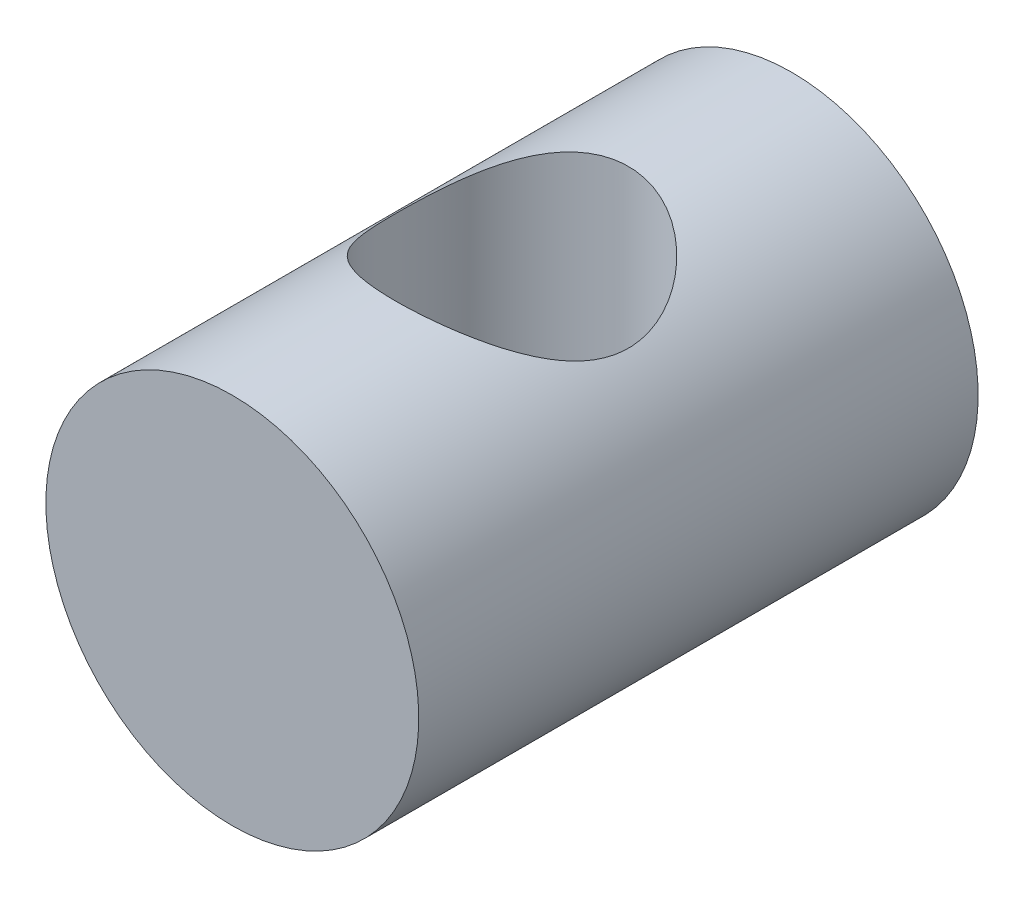
ISO-10303-21;
HEADER;
FILE_DESCRIPTION(('STEP AP214'),'2;1');
FILE_NAME('part.step','',(''),(''),'','','');
FILE_SCHEMA(('AUTOMOTIVE_DESIGN { 1 0 10303 214 1 1 1 1 }'));
ENDSEC;
DATA;
#1=APPLICATION_CONTEXT('core data for automotive mechanical design processes');
#2=APPLICATION_PROTOCOL_DEFINITION('international standard','automotive_design',2000,#1);
#3=PRODUCT_CONTEXT('',#1,'mechanical');
#4=PRODUCT('Part','Part','',(#3));
#5=PRODUCT_RELATED_PRODUCT_CATEGORY('part','',(#4));
#6=PRODUCT_DEFINITION_FORMATION('','',#4);
#7=PRODUCT_DEFINITION_CONTEXT('part definition',#1,'design');
#8=PRODUCT_DEFINITION('design','',#6,#7);
#9=PRODUCT_DEFINITION_SHAPE('','',#8);
#10=(LENGTH_UNIT() NAMED_UNIT(*) SI_UNIT(.MILLI.,.METRE.));
#11=(NAMED_UNIT(*) PLANE_ANGLE_UNIT() SI_UNIT($,.RADIAN.));
#12=(NAMED_UNIT(*) SI_UNIT($,.STERADIAN.) SOLID_ANGLE_UNIT());
#13=UNCERTAINTY_MEASURE_WITH_UNIT(LENGTH_MEASURE(1.E-05),#10,'distance_accuracy_value','');
#14=(GEOMETRIC_REPRESENTATION_CONTEXT(3) GLOBAL_UNCERTAINTY_ASSIGNED_CONTEXT((#13)) GLOBAL_UNIT_ASSIGNED_CONTEXT((#10,
#11,#12)) REPRESENTATION_CONTEXT('',''));
#15=CARTESIAN_POINT('',(0.,0.,0.));
#16=DIRECTION('',(0.,0.,1.));
#17=DIRECTION('',(1.,0.,0.));
#18=AXIS2_PLACEMENT_3D('',#15,#16,#17);
#19=CARTESIAN_POINT('',(0.,4.00000000000001,6.));
#20=DIRECTION('',(0.,0.,-1.));
#21=DIRECTION('',(0.,1.,0.));
#22=AXIS2_PLACEMENT_3D('',#19,#20,#21);
#23=PLANE('',#22);
#24=CARTESIAN_POINT('',(0.,0.,6.));
#25=DIRECTION('',(0.,0.,1.));
#26=DIRECTION('',(0.,-1.,0.));
#27=AXIS2_PLACEMENT_3D('',#24,#25,#26);
#28=CIRCLE('',#27,4.00000000000001);
#29=CARTESIAN_POINT('',(0.,-4.00000000000001,6.));
#30=VERTEX_POINT('',#29);
#31=EDGE_CURVE('E48',#30,#30,#28,.T.);
#32=ORIENTED_EDGE('',*,*,#31,.T.);
#33=EDGE_LOOP('',(#32));
#34=FACE_BOUND('',#33,.T.);
#35=ADVANCED_FACE('F30',(#34),#23,.F.);
#36=CARTESIAN_POINT('',(0.,4.,-6.));
#37=DIRECTION('',(0.,0.,1.));
#38=DIRECTION('',(0.,-1.,0.));
#39=AXIS2_PLACEMENT_3D('',#36,#37,#38);
#40=PLANE('',#39);
#41=CARTESIAN_POINT('',(0.,0.,-6.));
#42=DIRECTION('',(0.,0.,1.));
#43=DIRECTION('',(0.,-1.,0.));
#44=AXIS2_PLACEMENT_3D('',#41,#42,#43);
#45=CIRCLE('',#44,4.);
#46=CARTESIAN_POINT('',(0.,-4.,-6.));
#47=VERTEX_POINT('',#46);
#48=EDGE_CURVE('E44',#47,#47,#45,.T.);
#49=ORIENTED_EDGE('',*,*,#48,.F.);
#50=EDGE_LOOP('',(#49));
#51=FACE_BOUND('',#50,.T.);
#52=ADVANCED_FACE('F63',(#51),#40,.F.);
#53=CARTESIAN_POINT('',(0.,0.,6.));
#54=DIRECTION('',(0.,0.,1.));
#55=DIRECTION('',(0.,-1.,0.));
#56=AXIS2_PLACEMENT_3D('',#53,#54,#55);
#57=CYLINDRICAL_SURFACE('',#56,4.);
#58=CARTESIAN_POINT('',(0.,-4.,2.5));
#59=CARTESIAN_POINT('',(0.127017476559871,-3.99999041333572,2.49998952385639));
#60=CARTESIAN_POINT('',(0.254191951791703,-3.9938860659399,2.49025350009832));
#61=CARTESIAN_POINT('',(0.504637456621344,-3.97004375552587,2.45182887031573));
#62=CARTESIAN_POINT('',(0.627900575825985,-3.95228361873138,2.42310413973879));
#63=CARTESIAN_POINT('',(0.866410868269162,-3.90691695293563,2.34837714671246));
#64=CARTESIAN_POINT('',(0.98169442070943,-3.87935918690877,2.30246039021243));
#65=CARTESIAN_POINT('',(1.20252080434994,-3.81669199838278,2.19522833250853));
#66=CARTESIAN_POINT('',(1.30806471304098,-3.7815834126609,2.13391473744688));
#67=CARTESIAN_POINT('',(1.51594836437078,-3.70340304945467,1.9922268434089));
#68=CARTESIAN_POINT('',(1.61735911616791,-3.65991924217889,1.91072139729824));
#69=CARTESIAN_POINT('',(1.80597275567284,-3.57062700058922,1.73356165374148));
#70=CARTESIAN_POINT('',(1.89315621594405,-3.52481549782958,1.63788834426107));
#71=CARTESIAN_POINT('',(2.06285746302521,-3.42860837235627,1.41993221070879));
#72=CARTESIAN_POINT('',(2.14314412018317,-3.37843221966147,1.29580042656906));
#73=CARTESIAN_POINT('',(2.28147932079995,-3.28660396278105,1.03287036932165));
#74=CARTESIAN_POINT('',(2.33956541787438,-3.24493752000461,0.894097374832021));
#75=CARTESIAN_POINT('',(2.41866801180576,-3.18619151248815,0.642378952454283));
#76=CARTESIAN_POINT('',(2.44539104794679,-3.16553811970886,0.532066363081685));
#77=CARTESIAN_POINT('',(2.4836368711914,-3.1356271466086,0.307388148619314));
#78=CARTESIAN_POINT('',(2.49518112485638,-3.12635347378457,0.193028482826788));
#79=CARTESIAN_POINT('',(2.50237836690497,-3.12059771534501,-0.0368260328763664));
#80=CARTESIAN_POINT('',(2.49798968200884,-3.12414917427958,-0.15232307057796));
#81=CARTESIAN_POINT('',(2.47352633347829,-3.14354804883412,-0.380620208726635));
#82=CARTESIAN_POINT('',(2.45343909745149,-3.1594053196549,-0.493418072849926));
#83=CARTESIAN_POINT('',(2.3993620946426,-3.20065145822146,-0.710876896743595));
#84=CARTESIAN_POINT('',(2.36570043522604,-3.22581428653572,-0.815664879717374));
#85=CARTESIAN_POINT('',(2.28580369589507,-3.28291134443419,-1.01832239647321));
#86=CARTESIAN_POINT('',(2.2395641689404,-3.31484796808523,-1.11618946784346));
#87=CARTESIAN_POINT('',(2.12589830407261,-3.38909625095659,-1.32166640751016));
#88=CARTESIAN_POINT('',(2.05612773657747,-3.43223155208551,-1.42768105185238));
#89=CARTESIAN_POINT('',(1.90176111958637,-3.52011451554715,-1.6276611269764));
#90=CARTESIAN_POINT('',(1.81714983251341,-3.56486379714023,-1.72161400004514));
#91=CARTESIAN_POINT('',(1.61904732877734,-3.65959667460597,-1.91060100958261));
#92=CARTESIAN_POINT('',(1.50309447420016,-3.70922571443729,-2.0032559427216));
#93=CARTESIAN_POINT('',(1.25426444468514,-3.8005660184067,-2.16771179363102));
#94=CARTESIAN_POINT('',(1.12139395127005,-3.84228039228673,-2.23952090780949));
#95=CARTESIAN_POINT('',(0.91577575156744,-3.89435975869903,-2.32734595663498));
#96=CARTESIAN_POINT('',(0.848193583187391,-3.90966874385269,-2.3528342864304));
#97=CARTESIAN_POINT('',(0.710492049478443,-3.93701839875445,-2.39800765047864));
#98=CARTESIAN_POINT('',(0.640374175967897,-3.94906095588034,-2.41769603657082));
#99=CARTESIAN_POINT('',(0.49823901953847,-3.9694969952785,-2.45093416164239));
#100=CARTESIAN_POINT('',(0.426223500915274,-3.97789374843885,-2.464489403526));
#101=CARTESIAN_POINT('',(0.280965673560731,-3.99078766491331,-2.48524629331357));
#102=CARTESIAN_POINT('',(0.20772357657075,-3.99528549435854,-2.49244902654731));
#103=CARTESIAN_POINT('',(0.00911917689680461,-4.00193773474168,-2.50310930464354));
#104=CARTESIAN_POINT('',(-0.116782016705696,-4.00023812236601,-2.50040036312352));
#105=CARTESIAN_POINT('',(-0.365967766011668,-3.98518313408306,-2.47624033553455));
#106=CARTESIAN_POINT('',(-0.48925249935995,-3.97182855210102,-2.45479052607527));
#107=CARTESIAN_POINT('',(-0.725036194002601,-3.9354797555537,-2.39552141201722));
#108=CARTESIAN_POINT('',(-0.837768421062912,-3.91288306371127,-2.35837527923021));
#109=CARTESIAN_POINT('',(-1.05527816125332,-3.85991402897875,-2.26940762868757));
#110=CARTESIAN_POINT('',(-1.16005433861599,-3.82954038411642,-2.21758365349857));
#111=CARTESIAN_POINT('',(-1.37016761969194,-3.75980014020658,-2.09496946249217));
#112=CARTESIAN_POINT('',(-1.47449380296905,-3.71983526755373,-2.02279282772497));
#113=CARTESIAN_POINT('',(-1.67028541330073,-3.63613942885727,-1.86441230353071));
#114=CARTESIAN_POINT('',(-1.76173634038025,-3.59240430473134,-1.77819283111431));
#115=CARTESIAN_POINT('',(-1.94294835276253,-3.49811738486729,-1.57972991015435));
#116=CARTESIAN_POINT('',(-2.03053702733638,-3.44749766579192,-1.46552558450247));
#117=CARTESIAN_POINT('',(-2.18560704916439,-3.35133525746893,-1.22224843301743));
#118=CARTESIAN_POINT('',(-2.25310231693768,-3.3057890670837,-1.09318598710868));
#119=CARTESIAN_POINT('',(-2.35369543821018,-3.2346706057884,-0.850615703400426));
#120=CARTESIAN_POINT('',(-2.39103791720685,-3.20691272363805,-0.739518498611291));
#121=CARTESIAN_POINT('',(-2.45000216420748,-3.16210061351252,-0.511213708386551));
#122=CARTESIAN_POINT('',(-2.47164849805251,-3.14502966529821,-0.394015980310569));
#123=CARTESIAN_POINT('',(-2.49802767469226,-3.12412649932601,-0.155819447029602));
#124=CARTESIAN_POINT('',(-2.50266374586469,-3.12037003193166,-0.0348028321200665));
#125=CARTESIAN_POINT('',(-2.49439556773531,-3.12698126375719,0.206261923829517));
#126=CARTESIAN_POINT('',(-2.48148548821457,-3.1373536577048,0.326309729619358));
#127=CARTESIAN_POINT('',(-2.44076547086104,-3.1691077700999,0.55205957943611));
#128=CARTESIAN_POINT('',(-2.41423847191721,-3.18953614189074,0.65813856450238));
#129=CARTESIAN_POINT('',(-2.34835238743426,-3.23835062785226,0.86427015751826));
#130=CARTESIAN_POINT('',(-2.3089879509078,-3.26674005971309,0.964320231817276));
#131=CARTESIAN_POINT('',(-2.21205415803959,-3.33327797617853,1.17119332433814));
#132=CARTESIAN_POINT('',(-2.15267427981667,-3.3722442852408,1.27689994626374));
#133=CARTESIAN_POINT('',(-2.01999894889208,-3.45335445323995,1.47787738570926));
#134=CARTESIAN_POINT('',(-1.94669224594686,-3.49550086439,1.57313966737408));
#135=CARTESIAN_POINT('',(-1.77134669685941,-3.58803675426846,1.77002558379843));
#136=CARTESIAN_POINT('',(-1.66649284489892,-3.63840488260278,1.86916976153929));
#137=CARTESIAN_POINT('',(-1.43961937990848,-3.73398053838231,2.04900159612506));
#138=CARTESIAN_POINT('',(-1.3175892119665,-3.77918486147259,2.12967782367752));
#139=CARTESIAN_POINT('',(-1.12346357942551,-3.83959214728416,2.23456343855876));
#140=CARTESIAN_POINT('',(-1.05679601158094,-3.85851834157058,2.26687480004699));
#141=CARTESIAN_POINT('',(-0.920199584374059,-3.89335165397882,2.32567225182379));
#142=CARTESIAN_POINT('',(-0.850272633931981,-3.90926051225921,2.3521617011351));
#143=CARTESIAN_POINT('',(-0.707873688437763,-3.93753374175518,2.39885714446217));
#144=CARTESIAN_POINT('',(-0.635409144572261,-3.94990764965183,2.41908005724566));
#145=CARTESIAN_POINT('',(-0.488456989557111,-3.97075677458059,2.45297545558237));
#146=CARTESIAN_POINT('',(-0.413970913545524,-3.97923486692924,2.46665277243948));
#147=CARTESIAN_POINT('',(-0.282852605094048,-3.99038271291772,2.48459041022673));
#148=CARTESIAN_POINT('',(-0.226501515914867,-3.99398159517596,2.49036153025218));
#149=CARTESIAN_POINT('',(-0.113444074519046,-3.99879245372932,2.49806878362715));
#150=CARTESIAN_POINT('',(-0.0567377005313051,-4.00000428228699,2.50000467961036));
#151=CARTESIAN_POINT('',(0.,-4.,2.5));
#152=B_SPLINE_CURVE_WITH_KNOTS('',3,(#58,#59,#60,#61,#62,#63,#64,#65,#66,#67,#68,#69,#70,#71,
#72,#73,#74,#75,#76,#77,#78,#79,#80,#81,#82,#83,#84,#85,#86,#87,#88,#89,#90,#91,#92,#93,#94,#95,
#96,#97,#98,#99,#100,#101,#102,#103,#104,#105,#106,#107,#108,#109,#110,#111,#112,#113,#114,#115,
#116,#117,#118,#119,#120,#121,#122,#123,#124,#125,#126,#127,#128,#129,#130,#131,#132,#133,#134,
#135,#136,#137,#138,#139,#140,#141,#142,#143,#144,#145,#146,#147,#148,#149,#150,#151),
.UNSPECIFIED.,.T.,.F.,(4,2,2,2,2,2,2,2,2,2,2,2,2,2,2,2,2,2,2,2,2,2,2,2,2,2,2,2,2,2,2,2,2,2,2,2,
2,2,2,2,2,2,2,2,2,2,4),(0.,0.380824602868265,0.762375788256924,1.14205397519027,
1.52169010807759,1.93164374107244,2.34215256651403,2.80825951705947,3.27357449214021,
3.61824017759434,3.96241789414782,4.30749646997556,4.65285169010166,4.99031678920873,
5.32790135816066,5.7285490070872,6.12961045150364,6.59684361399044,7.06389281455723,
7.28510978359956,7.50619865744383,7.72708876613707,7.94794112831293,8.32363778110177,
8.69930884379593,9.06028425977629,9.42132014771965,9.81879878896137,10.216721545704,
10.6724083464246,11.1277787130885,11.4876929754247,11.8470427174174,12.2084336629143,
12.5699447204276,12.9023575499051,13.2349091154192,13.6156046298899,13.9966089922257,
14.4531049498526,14.9098826607203,15.1389848639481,15.3679545348469,15.5963005225023,
15.8244777070605,15.994578512822,16.1646898459841),.UNSPECIFIED.);
#153=CARTESIAN_POINT('',(0.,-4.,2.5));
#154=VERTEX_POINT('',#153);
#155=EDGE_CURVE('E10',#154,#154,#152,.T.);
#156=ORIENTED_EDGE('',*,*,#155,.T.);
#157=EDGE_LOOP('',(#156));
#158=FACE_BOUND('',#157,.T.);
#159=CARTESIAN_POINT('',(0.,4.00000000000001,2.5));
#160=CARTESIAN_POINT('',(-0.127017476559871,3.99999041333572,2.49998952385639));
#161=CARTESIAN_POINT('',(-0.254191951791703,3.9938860659399,2.49025350009832));
#162=CARTESIAN_POINT('',(-0.504637456621344,3.97004375552587,2.45182887031573));
#163=CARTESIAN_POINT('',(-0.627900575825985,3.95228361873138,2.4231041397388));
#164=CARTESIAN_POINT('',(-0.866410868269161,3.90691695293563,2.34837714671246));
#165=CARTESIAN_POINT('',(-0.981694420709429,3.87935918690877,2.30246039021243));
#166=CARTESIAN_POINT('',(-1.20252080434994,3.81669199838278,2.19522833250853));
#167=CARTESIAN_POINT('',(-1.30806471304098,3.7815834126609,2.13391473744688));
#168=CARTESIAN_POINT('',(-1.51594836437078,3.70340304945467,1.9922268434089));
#169=CARTESIAN_POINT('',(-1.61735911616791,3.65991924217889,1.91072139729824));
#170=CARTESIAN_POINT('',(-1.80597275567284,3.57062700058922,1.73356165374148));
#171=CARTESIAN_POINT('',(-1.89315621594404,3.52481549782958,1.63788834426107));
#172=CARTESIAN_POINT('',(-2.06285746302521,3.42860837235627,1.4199322107088));
#173=CARTESIAN_POINT('',(-2.14314412018317,3.37843221966147,1.29580042656906));
#174=CARTESIAN_POINT('',(-2.28147932079995,3.28660396278105,1.03287036932165));
#175=CARTESIAN_POINT('',(-2.33956541787438,3.24493752000461,0.894097374832024));
#176=CARTESIAN_POINT('',(-2.41866801180576,3.18619151248815,0.642378952454286));
#177=CARTESIAN_POINT('',(-2.44539104794679,3.16553811970886,0.532066363081687));
#178=CARTESIAN_POINT('',(-2.4836368711914,3.1356271466086,0.307388148619316));
#179=CARTESIAN_POINT('',(-2.49518112485638,3.12635347378457,0.19302848282679));
#180=CARTESIAN_POINT('',(-2.50237836690497,3.12059771534501,-0.0368260328763648));
#181=CARTESIAN_POINT('',(-2.49798968200884,3.12414917427958,-0.152323070577958));
#182=CARTESIAN_POINT('',(-2.47352633347829,3.14354804883412,-0.380620208726633));
#183=CARTESIAN_POINT('',(-2.45343909745149,3.1594053196549,-0.493418072849925));
#184=CARTESIAN_POINT('',(-2.3993620946426,3.20065145822146,-0.710876896743593));
#185=CARTESIAN_POINT('',(-2.36570043522604,3.22581428653572,-0.815664879717372));
#186=CARTESIAN_POINT('',(-2.28580369589507,3.28291134443419,-1.01832239647321));
#187=CARTESIAN_POINT('',(-2.2395641689404,3.31484796808523,-1.11618946784346));
#188=CARTESIAN_POINT('',(-2.12589830407261,3.38909625095658,-1.32166640751016));
#189=CARTESIAN_POINT('',(-2.05612773657747,3.43223155208551,-1.42768105185238));
#190=CARTESIAN_POINT('',(-1.90176111958637,3.52011451554715,-1.6276611269764));
#191=CARTESIAN_POINT('',(-1.81714983251341,3.56486379714022,-1.72161400004514));
#192=CARTESIAN_POINT('',(-1.61904732877734,3.65959667460597,-1.91060100958261));
#193=CARTESIAN_POINT('',(-1.50309447420017,3.70922571443728,-2.0032559427216));
#194=CARTESIAN_POINT('',(-1.25426444468514,3.8005660184067,-2.16771179363102));
#195=CARTESIAN_POINT('',(-1.12139395127005,3.84228039228673,-2.23952090780949));
#196=CARTESIAN_POINT('',(-0.915775751567443,3.89435975869903,-2.32734595663498));
#197=CARTESIAN_POINT('',(-0.848193583187394,3.90966874385268,-2.35283428643039));
#198=CARTESIAN_POINT('',(-0.710492049478446,3.93701839875445,-2.39800765047864));
#199=CARTESIAN_POINT('',(-0.6403741759679,3.94906095588034,-2.41769603657082));
#200=CARTESIAN_POINT('',(-0.498239019538473,3.9694969952785,-2.45093416164239));
#201=CARTESIAN_POINT('',(-0.426223500915277,3.97789374843885,-2.464489403526));
#202=CARTESIAN_POINT('',(-0.280965673560734,3.99078766491331,-2.48524629331357));
#203=CARTESIAN_POINT('',(-0.207723576570753,3.99528549435854,-2.49244902654731));
#204=CARTESIAN_POINT('',(-0.00911917689680784,4.00193773474168,-2.50310930464354));
#205=CARTESIAN_POINT('',(0.116782016705692,4.00023812236601,-2.50040036312352));
#206=CARTESIAN_POINT('',(0.365967766011664,3.98518313408306,-2.47624033553455));
#207=CARTESIAN_POINT('',(0.489252499359948,3.97182855210102,-2.45479052607527));
#208=CARTESIAN_POINT('',(0.725036194002599,3.9354797555537,-2.39552141201722));
#209=CARTESIAN_POINT('',(0.83776842106291,3.91288306371127,-2.35837527923021));
#210=CARTESIAN_POINT('',(1.05527816125332,3.85991402897875,-2.26940762868757));
#211=CARTESIAN_POINT('',(1.16005433861599,3.82954038411642,-2.21758365349857));
#212=CARTESIAN_POINT('',(1.37016761969194,3.75980014020658,-2.09496946249217));
#213=CARTESIAN_POINT('',(1.47449380296905,3.71983526755373,-2.02279282772497));
#214=CARTESIAN_POINT('',(1.67028541330073,3.63613942885727,-1.86441230353071));
#215=CARTESIAN_POINT('',(1.76173634038025,3.59240430473134,-1.77819283111431));
#216=CARTESIAN_POINT('',(1.94294835276253,3.49811738486729,-1.57972991015435));
#217=CARTESIAN_POINT('',(2.03053702733638,3.44749766579192,-1.46552558450248));
#218=CARTESIAN_POINT('',(2.18560704916439,3.35133525746893,-1.22224843301743));
#219=CARTESIAN_POINT('',(2.25310231693768,3.3057890670837,-1.09318598710869));
#220=CARTESIAN_POINT('',(2.35369543821018,3.2346706057884,-0.850615703400428));
#221=CARTESIAN_POINT('',(2.39103791720685,3.20691272363805,-0.739518498611293));
#222=CARTESIAN_POINT('',(2.45000216420748,3.16210061351253,-0.511213708386553));
#223=CARTESIAN_POINT('',(2.47164849805251,3.14502966529821,-0.394015980310572));
#224=CARTESIAN_POINT('',(2.49802767469226,3.12412649932601,-0.155819447029604));
#225=CARTESIAN_POINT('',(2.50266374586469,3.12037003193166,-0.0348028321200685));
#226=CARTESIAN_POINT('',(2.49439556773531,3.12698126375719,0.206261923829515));
#227=CARTESIAN_POINT('',(2.48148548821457,3.1373536577048,0.326309729619356));
#228=CARTESIAN_POINT('',(2.44076547086104,3.1691077700999,0.552059579436108));
#229=CARTESIAN_POINT('',(2.41423847191721,3.18953614189074,0.658138564502378));
#230=CARTESIAN_POINT('',(2.34835238743426,3.23835062785226,0.864270157518259));
#231=CARTESIAN_POINT('',(2.30898795090781,3.26674005971309,0.964320231817275));
#232=CARTESIAN_POINT('',(2.21205415803959,3.33327797617853,1.17119332433814));
#233=CARTESIAN_POINT('',(2.15267427981667,3.3722442852408,1.27689994626374));
#234=CARTESIAN_POINT('',(2.01999894889208,3.45335445323995,1.47787738570926));
#235=CARTESIAN_POINT('',(1.94669224594686,3.49550086438999,1.57313966737408));
#236=CARTESIAN_POINT('',(1.77134669685941,3.58803675426846,1.77002558379843));
#237=CARTESIAN_POINT('',(1.66649284489893,3.63840488260278,1.86916976153929));
#238=CARTESIAN_POINT('',(1.43961937990848,3.7339805383823,2.04900159612506));
#239=CARTESIAN_POINT('',(1.3175892119665,3.77918486147259,2.12967782367752));
#240=CARTESIAN_POINT('',(1.12346357942551,3.83959214728416,2.23456343855876));
#241=CARTESIAN_POINT('',(1.05679601158094,3.85851834157058,2.26687480004699));
#242=CARTESIAN_POINT('',(0.920199584374063,3.89335165397882,2.32567225182379));
#243=CARTESIAN_POINT('',(0.850272633931985,3.90926051225921,2.3521617011351));
#244=CARTESIAN_POINT('',(0.707873688437767,3.93753374175518,2.39885714446217));
#245=CARTESIAN_POINT('',(0.635409144572264,3.94990764965183,2.41908005724566));
#246=CARTESIAN_POINT('',(0.488456989557115,3.97075677458059,2.45297545558237));
#247=CARTESIAN_POINT('',(0.413970913545527,3.97923486692924,2.46665277243948));
#248=CARTESIAN_POINT('',(0.28285260509405,3.99038271291772,2.48459041022673));
#249=CARTESIAN_POINT('',(0.226501515914868,3.99398159517596,2.49036153025218));
#250=CARTESIAN_POINT('',(0.113444074519046,3.99879245372932,2.49806878362715));
#251=CARTESIAN_POINT('',(0.0567377005313051,4.000004282287,2.50000467961036));
#252=CARTESIAN_POINT('',(0.,4.00000000000001,2.5));
#253=B_SPLINE_CURVE_WITH_KNOTS('',3,(#159,#160,#161,#162,#163,#164,#165,#166,#167,#168,#169,
#170,#171,#172,#173,#174,#175,#176,#177,#178,#179,#180,#181,#182,#183,#184,#185,#186,#187,#188,
#189,#190,#191,#192,#193,#194,#195,#196,#197,#198,#199,#200,#201,#202,#203,#204,#205,#206,#207,
#208,#209,#210,#211,#212,#213,#214,#215,#216,#217,#218,#219,#220,#221,#222,#223,#224,#225,#226,
#227,#228,#229,#230,#231,#232,#233,#234,#235,#236,#237,#238,#239,#240,#241,#242,#243,#244,#245,
#246,#247,#248,#249,#250,#251,#252),.UNSPECIFIED.,.T.,.F.,(4,2,2,2,2,2,2,2,2,2,2,2,2,2,2,2,2,2,
2,2,2,2,2,2,2,2,2,2,2,2,2,2,2,2,2,2,2,2,2,2,2,2,2,2,2,2,4),(0.,0.380824602868265,
0.762375788256923,1.14205397519027,1.52169010807759,1.93164374107244,2.34215256651403,
2.80825951705947,3.27357449214021,3.61824017759434,3.96241789414781,4.30749646997556,
4.65285169010166,4.99031678920873,5.32790135816066,5.72854900708719,6.12961045150364,
6.59684361399044,7.06389281455722,7.28510978359955,7.50619865744383,7.72708876613707,
7.94794112831293,8.32363778110177,8.69930884379593,9.06028425977629,9.42132014771965,
9.81879878896137,10.216721545704,10.6724083464246,11.1277787130885,11.4876929754247,
11.8470427174174,12.2084336629143,12.5699447204276,12.9023575499051,13.2349091154192,
13.6156046298899,13.9966089922257,14.4531049498526,14.9098826607203,15.1389848639481,
15.3679545348469,15.5963005225023,15.8244777070605,15.994578512822,16.1646898459841),.UNSPECIFIED.);
#254=CARTESIAN_POINT('',(0.,4.00000000000001,2.5));
#255=VERTEX_POINT('',#254);
#256=EDGE_CURVE('E40',#255,#255,#253,.T.);
#257=ORIENTED_EDGE('',*,*,#256,.T.);
#258=EDGE_LOOP('',(#257));
#259=FACE_BOUND('',#258,.T.);
#260=ORIENTED_EDGE('',*,*,#31,.F.);
#261=EDGE_LOOP('',(#260));
#262=FACE_BOUND('',#261,.T.);
#263=ORIENTED_EDGE('',*,*,#48,.T.);
#264=EDGE_LOOP('',(#263));
#265=FACE_BOUND('',#264,.T.);
#266=ADVANCED_FACE('F53',(#158,#259,#262,#265),#57,.T.);
#267=CARTESIAN_POINT('',(0.,-4.00000000000001,0.));
#268=DIRECTION('',(0.,1.,0.));
#269=DIRECTION('',(0.,0.,1.));
#270=AXIS2_PLACEMENT_3D('',#267,#268,#269);
#271=CYLINDRICAL_SURFACE('',#270,2.5);
#272=ORIENTED_EDGE('',*,*,#256,.F.);
#273=EDGE_LOOP('',(#272));
#274=FACE_BOUND('',#273,.T.);
#275=ORIENTED_EDGE('',*,*,#155,.F.);
#276=EDGE_LOOP('',(#275));
#277=FACE_BOUND('',#276,.T.);
#278=ADVANCED_FACE('F55',(#274,#277),#271,.F.);
#279=CLOSED_SHELL('',(#35,#52,#266,#278));
#280=MANIFOLD_SOLID_BREP('B2',#279);
#281=ADVANCED_BREP_SHAPE_REPRESENTATION('',(#18,#280),#14);
#282=SHAPE_DEFINITION_REPRESENTATION(#9,#281);
ENDSEC;
END-ISO-10303-21;
